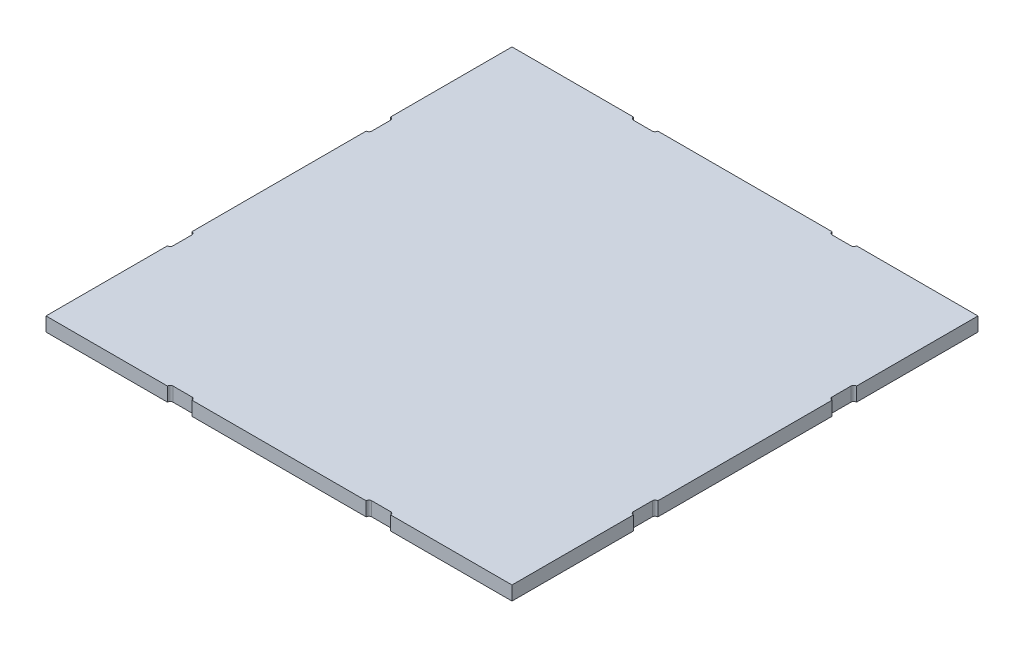
ISO-10303-21;
HEADER;
FILE_DESCRIPTION(('STEP AP214'),'2;1');
FILE_NAME('part.step','',(''),(''),'','','');
FILE_SCHEMA(('AUTOMOTIVE_DESIGN { 1 0 10303 214 1 1 1 1 }'));
ENDSEC;
DATA;
#1=APPLICATION_CONTEXT('core data for automotive mechanical design processes');
#2=APPLICATION_PROTOCOL_DEFINITION('international standard','automotive_design',2000,#1);
#3=PRODUCT_CONTEXT('',#1,'mechanical');
#4=PRODUCT('Part','Part','',(#3));
#5=PRODUCT_RELATED_PRODUCT_CATEGORY('part','',(#4));
#6=PRODUCT_DEFINITION_FORMATION('','',#4);
#7=PRODUCT_DEFINITION_CONTEXT('part definition',#1,'design');
#8=PRODUCT_DEFINITION('design','',#6,#7);
#9=PRODUCT_DEFINITION_SHAPE('','',#8);
#10=(LENGTH_UNIT() NAMED_UNIT(*) SI_UNIT(.MILLI.,.METRE.));
#11=(NAMED_UNIT(*) PLANE_ANGLE_UNIT() SI_UNIT($,.RADIAN.));
#12=(NAMED_UNIT(*) SI_UNIT($,.STERADIAN.) SOLID_ANGLE_UNIT());
#13=UNCERTAINTY_MEASURE_WITH_UNIT(LENGTH_MEASURE(1.E-05),#10,'distance_accuracy_value','');
#14=(GEOMETRIC_REPRESENTATION_CONTEXT(3) GLOBAL_UNCERTAINTY_ASSIGNED_CONTEXT((#13)) GLOBAL_UNIT_ASSIGNED_CONTEXT((#10,
#11,#12)) REPRESENTATION_CONTEXT('',''));
#15=CARTESIAN_POINT('',(0.,0.,0.));
#16=DIRECTION('',(0.,0.,1.));
#17=DIRECTION('',(1.,0.,0.));
#18=AXIS2_PLACEMENT_3D('',#15,#16,#17);
#19=CARTESIAN_POINT('',(-166.5,10.,-166.5));
#20=DIRECTION('',(0.,0.,1.));
#21=DIRECTION('',(1.,0.,0.));
#22=AXIS2_PLACEMENT_3D('',#19,#20,#21);
#23=PLANE('',#22);
#24=DIRECTION('',(-1.,0.,0.));
#25=VECTOR('',#24,1.);
#26=CARTESIAN_POINT('',(-166.5,0.,-166.5));
#27=LINE('',#26,#25);
#28=CARTESIAN_POINT('',(62.25,0.,-166.5));
#29=VERTEX_POINT('',#28);
#30=CARTESIAN_POINT('',(-62.25,0.,-166.5));
#31=VERTEX_POINT('',#30);
#32=EDGE_CURVE('E292',#29,#31,#27,.T.);
#33=ORIENTED_EDGE('',*,*,#32,.T.);
#34=DIRECTION('',(0.,1.,0.));
#35=VECTOR('',#34,1.);
#36=CARTESIAN_POINT('',(-62.25,0.,-166.5));
#37=LINE('',#36,#35);
#38=CARTESIAN_POINT('',(-62.25,10.,-166.5));
#39=VERTEX_POINT('',#38);
#40=EDGE_CURVE('E878',#31,#39,#37,.T.);
#41=ORIENTED_EDGE('',*,*,#40,.T.);
#42=DIRECTION('',(-1.,0.,0.));
#43=VECTOR('',#42,1.);
#44=CARTESIAN_POINT('',(-166.5,10.,-166.5));
#45=LINE('',#44,#43);
#46=CARTESIAN_POINT('',(62.25,10.,-166.5));
#47=VERTEX_POINT('',#46);
#48=EDGE_CURVE('E346',#47,#39,#45,.T.);
#49=ORIENTED_EDGE('',*,*,#48,.F.);
#50=DIRECTION('',(0.,1.,0.));
#51=VECTOR('',#50,1.);
#52=CARTESIAN_POINT('',(62.25,0.,-166.5));
#53=LINE('',#52,#51);
#54=EDGE_CURVE('E564',#29,#47,#53,.T.);
#55=ORIENTED_EDGE('',*,*,#54,.F.);
#56=EDGE_LOOP('',(#33,#41,#49,#55));
#57=FACE_BOUND('',#56,.T.);
#58=ADVANCED_FACE('F35',(#57),#23,.F.);
#59=CARTESIAN_POINT('',(166.5,0.,-166.5));
#60=VERTEX_POINT('',#59);
#61=CARTESIAN_POINT('',(79.75,0.,-166.5));
#62=VERTEX_POINT('',#61);
#63=EDGE_CURVE('E295',#60,#62,#27,.T.);
#64=ORIENTED_EDGE('',*,*,#63,.T.);
#65=DIRECTION('',(0.,1.,0.));
#66=VECTOR('',#65,1.);
#67=CARTESIAN_POINT('',(79.75,0.,-166.5));
#68=LINE('',#67,#66);
#69=CARTESIAN_POINT('',(79.75,10.,-166.5));
#70=VERTEX_POINT('',#69);
#71=EDGE_CURVE('E547',#62,#70,#68,.T.);
#72=ORIENTED_EDGE('',*,*,#71,.T.);
#73=CARTESIAN_POINT('',(166.5,10.,-166.5));
#74=VERTEX_POINT('',#73);
#75=EDGE_CURVE('E347',#74,#70,#45,.T.);
#76=ORIENTED_EDGE('',*,*,#75,.F.);
#77=DIRECTION('',(0.,-1.,0.));
#78=VECTOR('',#77,1.);
#79=CARTESIAN_POINT('',(166.5,10.,-166.5));
#80=LINE('',#79,#78);
#81=EDGE_CURVE('E11',#74,#60,#80,.T.);
#82=ORIENTED_EDGE('',*,*,#81,.T.);
#83=EDGE_LOOP('',(#64,#72,#76,#82));
#84=FACE_BOUND('',#83,.T.);
#85=ADVANCED_FACE('F546',(#84),#23,.F.);
#86=CARTESIAN_POINT('',(-166.5,10.,-166.5));
#87=DIRECTION('',(1.,0.,0.));
#88=DIRECTION('',(0.,0.,-1.));
#89=AXIS2_PLACEMENT_3D('',#86,#87,#88);
#90=PLANE('',#89);
#91=DIRECTION('',(0.,0.,1.));
#92=VECTOR('',#91,1.);
#93=CARTESIAN_POINT('',(-166.5,0.,-166.5));
#94=LINE('',#93,#92);
#95=CARTESIAN_POINT('',(-166.5,0.,-62.25));
#96=VERTEX_POINT('',#95);
#97=CARTESIAN_POINT('',(-166.5,0.,62.25));
#98=VERTEX_POINT('',#97);
#99=EDGE_CURVE('E307',#96,#98,#94,.T.);
#100=ORIENTED_EDGE('',*,*,#99,.T.);
#101=DIRECTION('',(0.,1.,0.));
#102=VECTOR('',#101,1.);
#103=CARTESIAN_POINT('',(-166.5,0.,62.25));
#104=LINE('',#103,#102);
#105=CARTESIAN_POINT('',(-166.5,10.,62.25));
#106=VERTEX_POINT('',#105);
#107=EDGE_CURVE('E581',#98,#106,#104,.T.);
#108=ORIENTED_EDGE('',*,*,#107,.T.);
#109=DIRECTION('',(0.,0.,1.));
#110=VECTOR('',#109,1.);
#111=CARTESIAN_POINT('',(-166.5,10.,-166.5));
#112=LINE('',#111,#110);
#113=CARTESIAN_POINT('',(-166.5,10.,-62.25));
#114=VERTEX_POINT('',#113);
#115=EDGE_CURVE('E353',#114,#106,#112,.T.);
#116=ORIENTED_EDGE('',*,*,#115,.F.);
#117=DIRECTION('',(0.,1.,0.));
#118=VECTOR('',#117,1.);
#119=CARTESIAN_POINT('',(-166.5,0.,-62.25));
#120=LINE('',#119,#118);
#121=EDGE_CURVE('E392',#96,#114,#120,.T.);
#122=ORIENTED_EDGE('',*,*,#121,.F.);
#123=EDGE_LOOP('',(#100,#108,#116,#122));
#124=FACE_BOUND('',#123,.T.);
#125=ADVANCED_FACE('F610',(#124),#90,.F.);
#126=CARTESIAN_POINT('',(-166.5,0.,-166.5));
#127=VERTEX_POINT('',#126);
#128=CARTESIAN_POINT('',(-166.5,0.,-79.75));
#129=VERTEX_POINT('',#128);
#130=EDGE_CURVE('E291',#127,#129,#94,.T.);
#131=ORIENTED_EDGE('',*,*,#130,.T.);
#132=DIRECTION('',(0.,1.,0.));
#133=VECTOR('',#132,1.);
#134=CARTESIAN_POINT('',(-166.5,0.,-79.75));
#135=LINE('',#134,#133);
#136=CARTESIAN_POINT('',(-166.5,10.,-79.75));
#137=VERTEX_POINT('',#136);
#138=EDGE_CURVE('E376',#129,#137,#135,.T.);
#139=ORIENTED_EDGE('',*,*,#138,.T.);
#140=CARTESIAN_POINT('',(-166.5,10.,-166.5));
#141=VERTEX_POINT('',#140);
#142=EDGE_CURVE('E354',#141,#137,#112,.T.);
#143=ORIENTED_EDGE('',*,*,#142,.F.);
#144=DIRECTION('',(0.,-1.,0.));
#145=VECTOR('',#144,1.);
#146=CARTESIAN_POINT('',(-166.5,10.,-166.5));
#147=LINE('',#146,#145);
#148=EDGE_CURVE('E43',#141,#127,#147,.T.);
#149=ORIENTED_EDGE('',*,*,#148,.T.);
#150=EDGE_LOOP('',(#131,#139,#143,#149));
#151=FACE_BOUND('',#150,.T.);
#152=ADVANCED_FACE('F375',(#151),#90,.F.);
#153=CARTESIAN_POINT('',(166.5,10.,-166.5));
#154=DIRECTION('',(-1.,0.,0.));
#155=DIRECTION('',(0.,0.,1.));
#156=AXIS2_PLACEMENT_3D('',#153,#154,#155);
#157=PLANE('',#156);
#158=DIRECTION('',(0.,0.,-1.));
#159=VECTOR('',#158,1.);
#160=CARTESIAN_POINT('',(166.5,0.,-166.5));
#161=LINE('',#160,#159);
#162=CARTESIAN_POINT('',(166.5,0.,62.25));
#163=VERTEX_POINT('',#162);
#164=CARTESIAN_POINT('',(166.5,0.,-62.25));
#165=VERTEX_POINT('',#164);
#166=EDGE_CURVE('E298',#163,#165,#161,.T.);
#167=ORIENTED_EDGE('',*,*,#166,.T.);
#168=DIRECTION('',(0.,1.,0.));
#169=VECTOR('',#168,1.);
#170=CARTESIAN_POINT('',(166.5,0.,-62.25));
#171=LINE('',#170,#169);
#172=CARTESIAN_POINT('',(166.5,10.,-62.25));
#173=VERTEX_POINT('',#172);
#174=EDGE_CURVE('E409',#165,#173,#171,.T.);
#175=ORIENTED_EDGE('',*,*,#174,.T.);
#176=DIRECTION('',(0.,0.,-1.));
#177=VECTOR('',#176,1.);
#178=CARTESIAN_POINT('',(166.5,10.,-166.5));
#179=LINE('',#178,#177);
#180=CARTESIAN_POINT('',(166.5,10.,62.25));
#181=VERTEX_POINT('',#180);
#182=EDGE_CURVE('E332',#181,#173,#179,.T.);
#183=ORIENTED_EDGE('',*,*,#182,.F.);
#184=DIRECTION('',(0.,1.,0.));
#185=VECTOR('',#184,1.);
#186=CARTESIAN_POINT('',(166.5,0.,62.25));
#187=LINE('',#186,#185);
#188=EDGE_CURVE('E454',#163,#181,#187,.T.);
#189=ORIENTED_EDGE('',*,*,#188,.F.);
#190=EDGE_LOOP('',(#167,#175,#183,#189));
#191=FACE_BOUND('',#190,.T.);
#192=ADVANCED_FACE('F532',(#191),#157,.F.);
#193=CARTESIAN_POINT('',(-166.5,10.,166.5));
#194=DIRECTION('',(0.,0.,-1.));
#195=DIRECTION('',(-1.,0.,0.));
#196=AXIS2_PLACEMENT_3D('',#193,#194,#195);
#197=PLANE('',#196);
#198=DIRECTION('',(1.,0.,0.));
#199=VECTOR('',#198,1.);
#200=CARTESIAN_POINT('',(-166.5,0.,166.5));
#201=LINE('',#200,#199);
#202=CARTESIAN_POINT('',(-62.25,0.,166.5));
#203=VERTEX_POINT('',#202);
#204=CARTESIAN_POINT('',(62.25,0.,166.5));
#205=VERTEX_POINT('',#204);
#206=EDGE_CURVE('E318',#203,#205,#201,.T.);
#207=ORIENTED_EDGE('',*,*,#206,.T.);
#208=DIRECTION('',(0.,1.,0.));
#209=VECTOR('',#208,1.);
#210=CARTESIAN_POINT('',(62.25,0.,166.5));
#211=LINE('',#210,#209);
#212=CARTESIAN_POINT('',(62.25,10.,166.5));
#213=VERTEX_POINT('',#212);
#214=EDGE_CURVE('E435',#205,#213,#211,.T.);
#215=ORIENTED_EDGE('',*,*,#214,.T.);
#216=DIRECTION('',(1.,0.,0.));
#217=VECTOR('',#216,1.);
#218=CARTESIAN_POINT('',(-166.5,10.,166.5));
#219=LINE('',#218,#217);
#220=CARTESIAN_POINT('',(-62.25,10.,166.5));
#221=VERTEX_POINT('',#220);
#222=EDGE_CURVE('E363',#221,#213,#219,.T.);
#223=ORIENTED_EDGE('',*,*,#222,.F.);
#224=DIRECTION('',(0.,1.,0.));
#225=VECTOR('',#224,1.);
#226=CARTESIAN_POINT('',(-62.25,0.,166.5));
#227=LINE('',#226,#225);
#228=EDGE_CURVE('E480',#203,#221,#227,.T.);
#229=ORIENTED_EDGE('',*,*,#228,.F.);
#230=EDGE_LOOP('',(#207,#215,#223,#229));
#231=FACE_BOUND('',#230,.T.);
#232=ADVANCED_FACE('F504',(#231),#197,.F.);
#233=CARTESIAN_POINT('',(166.5,0.,166.5));
#234=VERTEX_POINT('',#233);
#235=CARTESIAN_POINT('',(166.5,0.,79.75));
#236=VERTEX_POINT('',#235);
#237=EDGE_CURVE('E293',#234,#236,#161,.T.);
#238=ORIENTED_EDGE('',*,*,#237,.T.);
#239=DIRECTION('',(0.,1.,0.));
#240=VECTOR('',#239,1.);
#241=CARTESIAN_POINT('',(166.5,0.,79.75));
#242=LINE('',#241,#240);
#243=CARTESIAN_POINT('',(166.5,10.,79.75));
#244=VERTEX_POINT('',#243);
#245=EDGE_CURVE('E461',#236,#244,#242,.T.);
#246=ORIENTED_EDGE('',*,*,#245,.T.);
#247=CARTESIAN_POINT('',(166.5,10.,166.5));
#248=VERTEX_POINT('',#247);
#249=EDGE_CURVE('E334',#248,#244,#179,.T.);
#250=ORIENTED_EDGE('',*,*,#249,.F.);
#251=DIRECTION('',(0.,-1.,0.));
#252=VECTOR('',#251,1.);
#253=CARTESIAN_POINT('',(166.5,10.,166.5));
#254=LINE('',#253,#252);
#255=EDGE_CURVE('E368',#248,#234,#254,.T.);
#256=ORIENTED_EDGE('',*,*,#255,.T.);
#257=EDGE_LOOP('',(#238,#246,#250,#256));
#258=FACE_BOUND('',#257,.T.);
#259=ADVANCED_FACE('F515',(#258),#157,.F.);
#260=CARTESIAN_POINT('',(-166.5,0.,166.5));
#261=VERTEX_POINT('',#260);
#262=CARTESIAN_POINT('',(-79.75,0.,166.5));
#263=VERTEX_POINT('',#262);
#264=EDGE_CURVE('E319',#261,#263,#201,.T.);
#265=ORIENTED_EDGE('',*,*,#264,.T.);
#266=DIRECTION('',(0.,1.,0.));
#267=VECTOR('',#266,1.);
#268=CARTESIAN_POINT('',(-79.75,0.,166.5));
#269=LINE('',#268,#267);
#270=CARTESIAN_POINT('',(-79.75,10.,166.5));
#271=VERTEX_POINT('',#270);
#272=EDGE_CURVE('E487',#263,#271,#269,.T.);
#273=ORIENTED_EDGE('',*,*,#272,.T.);
#274=CARTESIAN_POINT('',(-166.5,10.,166.5));
#275=VERTEX_POINT('',#274);
#276=EDGE_CURVE('E364',#275,#271,#219,.T.);
#277=ORIENTED_EDGE('',*,*,#276,.F.);
#278=DIRECTION('',(0.,-1.,0.));
#279=VECTOR('',#278,1.);
#280=CARTESIAN_POINT('',(-166.5,10.,166.5));
#281=LINE('',#280,#279);
#282=EDGE_CURVE('E371',#275,#261,#281,.T.);
#283=ORIENTED_EDGE('',*,*,#282,.T.);
#284=EDGE_LOOP('',(#265,#273,#277,#283));
#285=FACE_BOUND('',#284,.T.);
#286=ADVANCED_FACE('F622',(#285),#197,.F.);
#287=CARTESIAN_POINT('',(166.5,10.,-79.75));
#288=VERTEX_POINT('',#287);
#289=EDGE_CURVE('E328',#288,#74,#179,.T.);
#290=ORIENTED_EDGE('',*,*,#289,.F.);
#291=DIRECTION('',(0.,1.,0.));
#292=VECTOR('',#291,1.);
#293=CARTESIAN_POINT('',(166.5,0.,-79.75));
#294=LINE('',#293,#292);
#295=CARTESIAN_POINT('',(166.5,0.,-79.75));
#296=VERTEX_POINT('',#295);
#297=EDGE_CURVE('E404',#296,#288,#294,.T.);
#298=ORIENTED_EDGE('',*,*,#297,.F.);
#299=EDGE_CURVE('E300',#296,#60,#161,.T.);
#300=ORIENTED_EDGE('',*,*,#299,.T.);
#301=ORIENTED_EDGE('',*,*,#81,.F.);
#302=EDGE_LOOP('',(#290,#298,#300,#301));
#303=FACE_BOUND('',#302,.T.);
#304=ADVANCED_FACE('F37',(#303),#157,.F.);
#305=CARTESIAN_POINT('',(-79.75,10.,-166.5));
#306=VERTEX_POINT('',#305);
#307=EDGE_CURVE('E284',#306,#141,#45,.T.);
#308=ORIENTED_EDGE('',*,*,#307,.F.);
#309=DIRECTION('',(0.,1.,0.));
#310=VECTOR('',#309,1.);
#311=CARTESIAN_POINT('',(-79.75,0.,-166.5));
#312=LINE('',#311,#310);
#313=CARTESIAN_POINT('',(-79.75,0.,-166.5));
#314=VERTEX_POINT('',#313);
#315=EDGE_CURVE('E271',#314,#306,#312,.T.);
#316=ORIENTED_EDGE('',*,*,#315,.F.);
#317=EDGE_CURVE('E282',#314,#127,#27,.T.);
#318=ORIENTED_EDGE('',*,*,#317,.T.);
#319=ORIENTED_EDGE('',*,*,#148,.F.);
#320=EDGE_LOOP('',(#308,#316,#318,#319));
#321=FACE_BOUND('',#320,.T.);
#322=ADVANCED_FACE('F280',(#321),#23,.F.);
#323=CARTESIAN_POINT('',(-166.5,10.,79.75));
#324=VERTEX_POINT('',#323);
#325=EDGE_CURVE('E351',#324,#275,#112,.T.);
#326=ORIENTED_EDGE('',*,*,#325,.F.);
#327=DIRECTION('',(0.,1.,0.));
#328=VECTOR('',#327,1.);
#329=CARTESIAN_POINT('',(-166.5,0.,79.75));
#330=LINE('',#329,#328);
#331=CARTESIAN_POINT('',(-166.5,0.,79.75));
#332=VERTEX_POINT('',#331);
#333=EDGE_CURVE('E576',#332,#324,#330,.T.);
#334=ORIENTED_EDGE('',*,*,#333,.F.);
#335=EDGE_CURVE('E303',#332,#261,#94,.T.);
#336=ORIENTED_EDGE('',*,*,#335,.T.);
#337=ORIENTED_EDGE('',*,*,#282,.F.);
#338=EDGE_LOOP('',(#326,#334,#336,#337));
#339=FACE_BOUND('',#338,.T.);
#340=ADVANCED_FACE('F621',(#339),#90,.F.);
#341=CARTESIAN_POINT('',(79.75,10.,166.5));
#342=VERTEX_POINT('',#341);
#343=EDGE_CURVE('E360',#342,#248,#219,.T.);
#344=ORIENTED_EDGE('',*,*,#343,.F.);
#345=DIRECTION('',(0.,1.,0.));
#346=VECTOR('',#345,1.);
#347=CARTESIAN_POINT('',(79.75,0.,166.5));
#348=LINE('',#347,#346);
#349=CARTESIAN_POINT('',(79.75,0.,166.5));
#350=VERTEX_POINT('',#349);
#351=EDGE_CURVE('E428',#350,#342,#348,.T.);
#352=ORIENTED_EDGE('',*,*,#351,.F.);
#353=EDGE_CURVE('E315',#350,#234,#201,.T.);
#354=ORIENTED_EDGE('',*,*,#353,.T.);
#355=ORIENTED_EDGE('',*,*,#255,.F.);
#356=EDGE_LOOP('',(#344,#352,#354,#355));
#357=FACE_BOUND('',#356,.T.);
#358=ADVANCED_FACE('F514',(#357),#197,.F.);
#359=CARTESIAN_POINT('',(0.,10.,0.));
#360=DIRECTION('',(0.,1.,0.));
#361=DIRECTION('',(0.,0.,1.));
#362=AXIS2_PLACEMENT_3D('',#359,#360,#361);
#363=PLANE('',#362);
#364=CARTESIAN_POINT('',(-64.25,10.,-166.5));
#365=DIRECTION('',(0.,1.,0.));
#366=DIRECTION('',(0.,0.,-1.));
#367=AXIS2_PLACEMENT_3D('',#364,#365,#366);
#368=CIRCLE('',#367,2.);
#369=CARTESIAN_POINT('',(-64.25,10.,-164.5));
#370=VERTEX_POINT('',#369);
#371=EDGE_CURVE('E276',#370,#39,#368,.T.);
#372=ORIENTED_EDGE('',*,*,#371,.F.);
#373=DIRECTION('',(1.,0.,0.));
#374=VECTOR('',#373,1.);
#375=CARTESIAN_POINT('',(-77.75,10.,-164.5));
#376=LINE('',#375,#374);
#377=CARTESIAN_POINT('',(-77.75,10.,-164.5));
#378=VERTEX_POINT('',#377);
#379=EDGE_CURVE('E867',#378,#370,#376,.T.);
#380=ORIENTED_EDGE('',*,*,#379,.F.);
#381=CARTESIAN_POINT('',(-77.75,10.,-166.5));
#382=DIRECTION('',(0.,1.,0.));
#383=DIRECTION('',(0.,0.,-1.));
#384=AXIS2_PLACEMENT_3D('',#381,#382,#383);
#385=CIRCLE('',#384,2.);
#386=EDGE_CURVE('E870',#306,#378,#385,.T.);
#387=ORIENTED_EDGE('',*,*,#386,.F.);
#388=ORIENTED_EDGE('',*,*,#307,.T.);
#389=ORIENTED_EDGE('',*,*,#142,.T.);
#390=CARTESIAN_POINT('',(-166.5,10.,-77.75));
#391=DIRECTION('',(0.,1.,0.));
#392=DIRECTION('',(0.,0.,1.));
#393=AXIS2_PLACEMENT_3D('',#390,#391,#392);
#394=CIRCLE('',#393,2.);
#395=CARTESIAN_POINT('',(-164.5,10.,-77.75));
#396=VERTEX_POINT('',#395);
#397=EDGE_CURVE('E388',#396,#137,#394,.T.);
#398=ORIENTED_EDGE('',*,*,#397,.F.);
#399=DIRECTION('',(0.,0.,-1.));
#400=VECTOR('',#399,1.);
#401=CARTESIAN_POINT('',(-164.5,10.,-64.25));
#402=LINE('',#401,#400);
#403=CARTESIAN_POINT('',(-164.5,10.,-64.25));
#404=VERTEX_POINT('',#403);
#405=EDGE_CURVE('E598',#404,#396,#402,.T.);
#406=ORIENTED_EDGE('',*,*,#405,.F.);
#407=CARTESIAN_POINT('',(-166.5,10.,-64.25));
#408=DIRECTION('',(0.,1.,0.));
#409=DIRECTION('',(0.,0.,-1.));
#410=AXIS2_PLACEMENT_3D('',#407,#408,#409);
#411=CIRCLE('',#410,2.);
#412=EDGE_CURVE('E584',#114,#404,#411,.T.);
#413=ORIENTED_EDGE('',*,*,#412,.F.);
#414=ORIENTED_EDGE('',*,*,#115,.T.);
#415=CARTESIAN_POINT('',(-166.5,10.,64.25));
#416=DIRECTION('',(0.,1.,0.));
#417=DIRECTION('',(0.,0.,1.));
#418=AXIS2_PLACEMENT_3D('',#415,#416,#417);
#419=CIRCLE('',#418,2.);
#420=CARTESIAN_POINT('',(-164.5,10.,64.25));
#421=VERTEX_POINT('',#420);
#422=EDGE_CURVE('E571',#421,#106,#419,.T.);
#423=ORIENTED_EDGE('',*,*,#422,.F.);
#424=DIRECTION('',(0.,0.,-1.));
#425=VECTOR('',#424,1.);
#426=CARTESIAN_POINT('',(-164.5,10.,64.25));
#427=LINE('',#426,#425);
#428=CARTESIAN_POINT('',(-164.5,10.,77.75));
#429=VERTEX_POINT('',#428);
#430=EDGE_CURVE('E555',#429,#421,#427,.T.);
#431=ORIENTED_EDGE('',*,*,#430,.F.);
#432=CARTESIAN_POINT('',(-166.5,10.,77.75));
#433=DIRECTION('',(0.,1.,0.));
#434=DIRECTION('',(0.,0.,-1.));
#435=AXIS2_PLACEMENT_3D('',#432,#433,#434);
#436=CIRCLE('',#435,2.);
#437=EDGE_CURVE('E551',#324,#429,#436,.T.);
#438=ORIENTED_EDGE('',*,*,#437,.F.);
#439=ORIENTED_EDGE('',*,*,#325,.T.);
#440=ORIENTED_EDGE('',*,*,#276,.T.);
#441=CARTESIAN_POINT('',(-77.75,10.,166.5));
#442=DIRECTION('',(0.,1.,0.));
#443=DIRECTION('',(0.,0.,1.));
#444=AXIS2_PLACEMENT_3D('',#441,#442,#443);
#445=CIRCLE('',#444,2.);
#446=CARTESIAN_POINT('',(-77.75,10.,164.5));
#447=VERTEX_POINT('',#446);
#448=EDGE_CURVE('E474',#447,#271,#445,.T.);
#449=ORIENTED_EDGE('',*,*,#448,.F.);
#450=DIRECTION('',(-1.,0.,0.));
#451=VECTOR('',#450,1.);
#452=CARTESIAN_POINT('',(-77.75,10.,164.5));
#453=LINE('',#452,#451);
#454=CARTESIAN_POINT('',(-64.25,10.,164.5));
#455=VERTEX_POINT('',#454);
#456=EDGE_CURVE('E483',#455,#447,#453,.T.);
#457=ORIENTED_EDGE('',*,*,#456,.F.);
#458=CARTESIAN_POINT('',(-64.25,10.,166.5));
#459=DIRECTION('',(0.,1.,0.));
#460=DIRECTION('',(0.,0.,1.));
#461=AXIS2_PLACEMENT_3D('',#458,#459,#460);
#462=CIRCLE('',#461,2.);
#463=EDGE_CURVE('E464',#221,#455,#462,.T.);
#464=ORIENTED_EDGE('',*,*,#463,.F.);
#465=ORIENTED_EDGE('',*,*,#222,.T.);
#466=CARTESIAN_POINT('',(64.25,10.,166.5));
#467=DIRECTION('',(0.,1.,0.));
#468=DIRECTION('',(0.,0.,-1.));
#469=AXIS2_PLACEMENT_3D('',#466,#467,#468);
#470=CIRCLE('',#469,2.);
#471=CARTESIAN_POINT('',(64.25,10.,164.5));
#472=VERTEX_POINT('',#471);
#473=EDGE_CURVE('E422',#472,#213,#470,.T.);
#474=ORIENTED_EDGE('',*,*,#473,.F.);
#475=DIRECTION('',(-1.,0.,0.));
#476=VECTOR('',#475,1.);
#477=CARTESIAN_POINT('',(77.75,10.,164.5));
#478=LINE('',#477,#476);
#479=CARTESIAN_POINT('',(77.75,10.,164.5));
#480=VERTEX_POINT('',#479);
#481=EDGE_CURVE('E431',#480,#472,#478,.T.);
#482=ORIENTED_EDGE('',*,*,#481,.F.);
#483=CARTESIAN_POINT('',(77.75,10.,166.5));
#484=DIRECTION('',(0.,1.,0.));
#485=DIRECTION('',(0.,0.,-1.));
#486=AXIS2_PLACEMENT_3D('',#483,#484,#485);
#487=CIRCLE('',#486,2.);
#488=EDGE_CURVE('E412',#342,#480,#487,.T.);
#489=ORIENTED_EDGE('',*,*,#488,.F.);
#490=ORIENTED_EDGE('',*,*,#343,.T.);
#491=ORIENTED_EDGE('',*,*,#249,.T.);
#492=CARTESIAN_POINT('',(166.5,10.,77.75));
#493=DIRECTION('',(0.,1.,0.));
#494=DIRECTION('',(0.,0.,1.));
#495=AXIS2_PLACEMENT_3D('',#492,#493,#494);
#496=CIRCLE('',#495,2.);
#497=CARTESIAN_POINT('',(164.5,10.,77.75));
#498=VERTEX_POINT('',#497);
#499=EDGE_CURVE('E448',#498,#244,#496,.T.);
#500=ORIENTED_EDGE('',*,*,#499,.F.);
#501=DIRECTION('',(0.,0.,1.));
#502=VECTOR('',#501,1.);
#503=CARTESIAN_POINT('',(164.5,10.,64.25));
#504=LINE('',#503,#502);
#505=CARTESIAN_POINT('',(164.5,10.,64.25));
#506=VERTEX_POINT('',#505);
#507=EDGE_CURVE('E457',#506,#498,#504,.T.);
#508=ORIENTED_EDGE('',*,*,#507,.F.);
#509=CARTESIAN_POINT('',(166.5,10.,64.25));
#510=DIRECTION('',(0.,1.,0.));
#511=DIRECTION('',(0.,0.,-1.));
#512=AXIS2_PLACEMENT_3D('',#509,#510,#511);
#513=CIRCLE('',#512,2.);
#514=EDGE_CURVE('E438',#181,#506,#513,.T.);
#515=ORIENTED_EDGE('',*,*,#514,.F.);
#516=ORIENTED_EDGE('',*,*,#182,.T.);
#517=CARTESIAN_POINT('',(166.5,10.,-64.25));
#518=DIRECTION('',(0.,1.,0.));
#519=DIRECTION('',(0.,0.,1.));
#520=AXIS2_PLACEMENT_3D('',#517,#518,#519);
#521=CIRCLE('',#520,2.);
#522=CARTESIAN_POINT('',(164.5,10.,-64.25));
#523=VERTEX_POINT('',#522);
#524=EDGE_CURVE('E399',#523,#173,#521,.T.);
#525=ORIENTED_EDGE('',*,*,#524,.F.);
#526=DIRECTION('',(0.,0.,1.));
#527=VECTOR('',#526,1.);
#528=CARTESIAN_POINT('',(164.5,10.,-64.25));
#529=LINE('',#528,#527);
#530=CARTESIAN_POINT('',(164.5,10.,-77.75));
#531=VERTEX_POINT('',#530);
#532=EDGE_CURVE('E383',#531,#523,#529,.T.);
#533=ORIENTED_EDGE('',*,*,#532,.F.);
#534=CARTESIAN_POINT('',(166.5,10.,-77.75));
#535=DIRECTION('',(0.,1.,0.));
#536=DIRECTION('',(0.,0.,-1.));
#537=AXIS2_PLACEMENT_3D('',#534,#535,#536);
#538=CIRCLE('',#537,2.);
#539=EDGE_CURVE('E379',#288,#531,#538,.T.);
#540=ORIENTED_EDGE('',*,*,#539,.F.);
#541=ORIENTED_EDGE('',*,*,#289,.T.);
#542=ORIENTED_EDGE('',*,*,#75,.T.);
#543=CARTESIAN_POINT('',(77.75,10.,-166.5));
#544=DIRECTION('',(0.,1.,0.));
#545=DIRECTION('',(0.,0.,1.));
#546=AXIS2_PLACEMENT_3D('',#543,#544,#545);
#547=CIRCLE('',#546,2.);
#548=CARTESIAN_POINT('',(77.75,10.,-164.5));
#549=VERTEX_POINT('',#548);
#550=EDGE_CURVE('E560',#549,#70,#547,.T.);
#551=ORIENTED_EDGE('',*,*,#550,.F.);
#552=DIRECTION('',(1.,0.,0.));
#553=VECTOR('',#552,1.);
#554=CARTESIAN_POINT('',(77.75,10.,-164.5));
#555=LINE('',#554,#553);
#556=CARTESIAN_POINT('',(64.25,10.,-164.5));
#557=VERTEX_POINT('',#556);
#558=EDGE_CURVE('E889',#557,#549,#555,.T.);
#559=ORIENTED_EDGE('',*,*,#558,.F.);
#560=CARTESIAN_POINT('',(64.25,10.,-166.5));
#561=DIRECTION('',(0.,1.,0.));
#562=DIRECTION('',(0.,0.,1.));
#563=AXIS2_PLACEMENT_3D('',#560,#561,#562);
#564=CIRCLE('',#563,2.);
#565=EDGE_CURVE('E880',#47,#557,#564,.T.);
#566=ORIENTED_EDGE('',*,*,#565,.F.);
#567=ORIENTED_EDGE('',*,*,#48,.T.);
#568=EDGE_LOOP('',(#372,#380,#387,#388,#389,#398,#406,#413,#414,#423,#431,#438,#439,#440,#449,
#457,#464,#465,#474,#482,#489,#490,#491,#500,#508,#515,#516,#525,#533,#540,#541,#542,#551,#559,
#566,#567));
#569=FACE_BOUND('',#568,.T.);
#570=ADVANCED_FACE('F502',(#569),#363,.T.);
#571=CARTESIAN_POINT('',(0.,0.,0.));
#572=DIRECTION('',(0.,1.,0.));
#573=DIRECTION('',(0.,0.,1.));
#574=AXIS2_PLACEMENT_3D('',#571,#572,#573);
#575=PLANE('',#574);
#576=DIRECTION('',(1.,0.,0.));
#577=VECTOR('',#576,1.);
#578=CARTESIAN_POINT('',(-77.75,0.,-164.5));
#579=LINE('',#578,#577);
#580=CARTESIAN_POINT('',(-77.75,0.,-164.5));
#581=VERTEX_POINT('',#580);
#582=CARTESIAN_POINT('',(-64.25,0.,-164.5));
#583=VERTEX_POINT('',#582);
#584=EDGE_CURVE('E50',#581,#583,#579,.T.);
#585=ORIENTED_EDGE('',*,*,#584,.T.);
#586=CARTESIAN_POINT('',(-64.25,0.,-166.5));
#587=DIRECTION('',(0.,1.,0.));
#588=DIRECTION('',(0.,0.,-1.));
#589=AXIS2_PLACEMENT_3D('',#586,#587,#588);
#590=CIRCLE('',#589,2.);
#591=EDGE_CURVE('E285',#583,#31,#590,.T.);
#592=ORIENTED_EDGE('',*,*,#591,.T.);
#593=ORIENTED_EDGE('',*,*,#32,.F.);
#594=CARTESIAN_POINT('',(64.25,0.,-166.5));
#595=DIRECTION('',(0.,1.,0.));
#596=DIRECTION('',(0.,0.,1.));
#597=AXIS2_PLACEMENT_3D('',#594,#595,#596);
#598=CIRCLE('',#597,2.);
#599=CARTESIAN_POINT('',(64.25,0.,-164.5));
#600=VERTEX_POINT('',#599);
#601=EDGE_CURVE('E883',#29,#600,#598,.T.);
#602=ORIENTED_EDGE('',*,*,#601,.T.);
#603=DIRECTION('',(1.,0.,0.));
#604=VECTOR('',#603,1.);
#605=CARTESIAN_POINT('',(77.75,0.,-164.5));
#606=LINE('',#605,#604);
#607=CARTESIAN_POINT('',(77.75,0.,-164.5));
#608=VERTEX_POINT('',#607);
#609=EDGE_CURVE('E58',#600,#608,#606,.T.);
#610=ORIENTED_EDGE('',*,*,#609,.T.);
#611=CARTESIAN_POINT('',(77.75,0.,-166.5));
#612=DIRECTION('',(0.,1.,0.));
#613=DIRECTION('',(0.,0.,1.));
#614=AXIS2_PLACEMENT_3D('',#611,#612,#613);
#615=CIRCLE('',#614,2.);
#616=EDGE_CURVE('E566',#608,#62,#615,.T.);
#617=ORIENTED_EDGE('',*,*,#616,.T.);
#618=ORIENTED_EDGE('',*,*,#63,.F.);
#619=ORIENTED_EDGE('',*,*,#299,.F.);
#620=CARTESIAN_POINT('',(166.5,0.,-77.75));
#621=DIRECTION('',(0.,1.,0.));
#622=DIRECTION('',(0.,0.,-1.));
#623=AXIS2_PLACEMENT_3D('',#620,#621,#622);
#624=CIRCLE('',#623,2.);
#625=CARTESIAN_POINT('',(164.5,0.,-77.75));
#626=VERTEX_POINT('',#625);
#627=EDGE_CURVE('E395',#296,#626,#624,.T.);
#628=ORIENTED_EDGE('',*,*,#627,.T.);
#629=DIRECTION('',(0.,0.,1.));
#630=VECTOR('',#629,1.);
#631=CARTESIAN_POINT('',(164.5,0.,-64.25));
#632=LINE('',#631,#630);
#633=CARTESIAN_POINT('',(164.5,0.,-64.25));
#634=VERTEX_POINT('',#633);
#635=EDGE_CURVE('E398',#626,#634,#632,.T.);
#636=ORIENTED_EDGE('',*,*,#635,.T.);
#637=CARTESIAN_POINT('',(166.5,0.,-64.25));
#638=DIRECTION('',(0.,1.,0.));
#639=DIRECTION('',(0.,0.,1.));
#640=AXIS2_PLACEMENT_3D('',#637,#638,#639);
#641=CIRCLE('',#640,2.);
#642=EDGE_CURVE('E402',#634,#165,#641,.T.);
#643=ORIENTED_EDGE('',*,*,#642,.T.);
#644=ORIENTED_EDGE('',*,*,#166,.F.);
#645=CARTESIAN_POINT('',(166.5,0.,64.25));
#646=DIRECTION('',(0.,1.,0.));
#647=DIRECTION('',(0.,0.,-1.));
#648=AXIS2_PLACEMENT_3D('',#645,#646,#647);
#649=CIRCLE('',#648,2.);
#650=CARTESIAN_POINT('',(164.5,0.,64.25));
#651=VERTEX_POINT('',#650);
#652=EDGE_CURVE('E444',#163,#651,#649,.T.);
#653=ORIENTED_EDGE('',*,*,#652,.T.);
#654=DIRECTION('',(0.,0.,1.));
#655=VECTOR('',#654,1.);
#656=CARTESIAN_POINT('',(164.5,0.,64.25));
#657=LINE('',#656,#655);
#658=CARTESIAN_POINT('',(164.5,0.,77.75));
#659=VERTEX_POINT('',#658);
#660=EDGE_CURVE('E447',#651,#659,#657,.T.);
#661=ORIENTED_EDGE('',*,*,#660,.T.);
#662=CARTESIAN_POINT('',(166.5,0.,77.75));
#663=DIRECTION('',(0.,1.,0.));
#664=DIRECTION('',(0.,0.,1.));
#665=AXIS2_PLACEMENT_3D('',#662,#663,#664);
#666=CIRCLE('',#665,2.);
#667=EDGE_CURVE('E451',#659,#236,#666,.T.);
#668=ORIENTED_EDGE('',*,*,#667,.T.);
#669=ORIENTED_EDGE('',*,*,#237,.F.);
#670=ORIENTED_EDGE('',*,*,#353,.F.);
#671=CARTESIAN_POINT('',(77.75,0.,166.5));
#672=DIRECTION('',(0.,1.,0.));
#673=DIRECTION('',(0.,0.,-1.));
#674=AXIS2_PLACEMENT_3D('',#671,#672,#673);
#675=CIRCLE('',#674,2.);
#676=CARTESIAN_POINT('',(77.75,0.,164.5));
#677=VERTEX_POINT('',#676);
#678=EDGE_CURVE('E418',#350,#677,#675,.T.);
#679=ORIENTED_EDGE('',*,*,#678,.T.);
#680=DIRECTION('',(-1.,0.,0.));
#681=VECTOR('',#680,1.);
#682=CARTESIAN_POINT('',(77.75,0.,164.5));
#683=LINE('',#682,#681);
#684=CARTESIAN_POINT('',(64.25,0.,164.5));
#685=VERTEX_POINT('',#684);
#686=EDGE_CURVE('E421',#677,#685,#683,.T.);
#687=ORIENTED_EDGE('',*,*,#686,.T.);
#688=CARTESIAN_POINT('',(64.25,0.,166.5));
#689=DIRECTION('',(0.,1.,0.));
#690=DIRECTION('',(0.,0.,-1.));
#691=AXIS2_PLACEMENT_3D('',#688,#689,#690);
#692=CIRCLE('',#691,2.);
#693=EDGE_CURVE('E425',#685,#205,#692,.T.);
#694=ORIENTED_EDGE('',*,*,#693,.T.);
#695=ORIENTED_EDGE('',*,*,#206,.F.);
#696=CARTESIAN_POINT('',(-64.25,0.,166.5));
#697=DIRECTION('',(0.,1.,0.));
#698=DIRECTION('',(0.,0.,1.));
#699=AXIS2_PLACEMENT_3D('',#696,#697,#698);
#700=CIRCLE('',#699,2.);
#701=CARTESIAN_POINT('',(-64.25,0.,164.5));
#702=VERTEX_POINT('',#701);
#703=EDGE_CURVE('E470',#203,#702,#700,.T.);
#704=ORIENTED_EDGE('',*,*,#703,.T.);
#705=DIRECTION('',(-1.,0.,0.));
#706=VECTOR('',#705,1.);
#707=CARTESIAN_POINT('',(-77.75,0.,164.5));
#708=LINE('',#707,#706);
#709=CARTESIAN_POINT('',(-77.75,0.,164.5));
#710=VERTEX_POINT('',#709);
#711=EDGE_CURVE('E473',#702,#710,#708,.T.);
#712=ORIENTED_EDGE('',*,*,#711,.T.);
#713=CARTESIAN_POINT('',(-77.75,0.,166.5));
#714=DIRECTION('',(0.,1.,0.));
#715=DIRECTION('',(0.,0.,1.));
#716=AXIS2_PLACEMENT_3D('',#713,#714,#715);
#717=CIRCLE('',#716,2.);
#718=EDGE_CURVE('E477',#710,#263,#717,.T.);
#719=ORIENTED_EDGE('',*,*,#718,.T.);
#720=ORIENTED_EDGE('',*,*,#264,.F.);
#721=ORIENTED_EDGE('',*,*,#335,.F.);
#722=CARTESIAN_POINT('',(-166.5,0.,77.75));
#723=DIRECTION('',(0.,1.,0.));
#724=DIRECTION('',(0.,0.,-1.));
#725=AXIS2_PLACEMENT_3D('',#722,#723,#724);
#726=CIRCLE('',#725,2.);
#727=CARTESIAN_POINT('',(-164.5,0.,77.75));
#728=VERTEX_POINT('',#727);
#729=EDGE_CURVE('E567',#332,#728,#726,.T.);
#730=ORIENTED_EDGE('',*,*,#729,.T.);
#731=DIRECTION('',(0.,0.,-1.));
#732=VECTOR('',#731,1.);
#733=CARTESIAN_POINT('',(-164.5,0.,64.25));
#734=LINE('',#733,#732);
#735=CARTESIAN_POINT('',(-164.5,0.,64.25));
#736=VERTEX_POINT('',#735);
#737=EDGE_CURVE('E570',#728,#736,#734,.T.);
#738=ORIENTED_EDGE('',*,*,#737,.T.);
#739=CARTESIAN_POINT('',(-166.5,0.,64.25));
#740=DIRECTION('',(0.,1.,0.));
#741=DIRECTION('',(0.,0.,1.));
#742=AXIS2_PLACEMENT_3D('',#739,#740,#741);
#743=CIRCLE('',#742,2.);
#744=EDGE_CURVE('E574',#736,#98,#743,.T.);
#745=ORIENTED_EDGE('',*,*,#744,.T.);
#746=ORIENTED_EDGE('',*,*,#99,.F.);
#747=CARTESIAN_POINT('',(-166.5,0.,-64.25));
#748=DIRECTION('',(0.,1.,0.));
#749=DIRECTION('',(0.,0.,-1.));
#750=AXIS2_PLACEMENT_3D('',#747,#748,#749);
#751=CIRCLE('',#750,2.);
#752=CARTESIAN_POINT('',(-164.5,0.,-64.25));
#753=VERTEX_POINT('',#752);
#754=EDGE_CURVE('E590',#96,#753,#751,.T.);
#755=ORIENTED_EDGE('',*,*,#754,.T.);
#756=DIRECTION('',(0.,0.,-1.));
#757=VECTOR('',#756,1.);
#758=CARTESIAN_POINT('',(-164.5,0.,-64.25));
#759=LINE('',#758,#757);
#760=CARTESIAN_POINT('',(-164.5,0.,-77.75));
#761=VERTEX_POINT('',#760);
#762=EDGE_CURVE('E593',#753,#761,#759,.T.);
#763=ORIENTED_EDGE('',*,*,#762,.T.);
#764=CARTESIAN_POINT('',(-166.5,0.,-77.75));
#765=DIRECTION('',(0.,1.,0.));
#766=DIRECTION('',(0.,0.,1.));
#767=AXIS2_PLACEMENT_3D('',#764,#765,#766);
#768=CIRCLE('',#767,2.);
#769=EDGE_CURVE('E394',#761,#129,#768,.T.);
#770=ORIENTED_EDGE('',*,*,#769,.T.);
#771=ORIENTED_EDGE('',*,*,#130,.F.);
#772=ORIENTED_EDGE('',*,*,#317,.F.);
#773=CARTESIAN_POINT('',(-77.75,0.,-166.5));
#774=DIRECTION('',(0.,1.,0.));
#775=DIRECTION('',(0.,0.,-1.));
#776=AXIS2_PLACEMENT_3D('',#773,#774,#775);
#777=CIRCLE('',#776,2.);
#778=EDGE_CURVE('E267',#314,#581,#777,.T.);
#779=ORIENTED_EDGE('',*,*,#778,.T.);
#780=EDGE_LOOP('',(#585,#592,#593,#602,#610,#617,#618,#619,#628,#636,#643,#644,#653,#661,#668,
#669,#670,#679,#687,#694,#695,#704,#712,#719,#720,#721,#730,#738,#745,#746,#755,#763,#770,#771,
#772,#779));
#781=FACE_BOUND('',#780,.T.);
#782=ADVANCED_FACE('F288',(#781),#575,.F.);
#783=CARTESIAN_POINT('',(-77.75,0.,166.5));
#784=DIRECTION('',(0.,1.,0.));
#785=DIRECTION('',(0.,0.,1.));
#786=AXIS2_PLACEMENT_3D('',#783,#784,#785);
#787=CYLINDRICAL_SURFACE('',#786,2.);
#788=ORIENTED_EDGE('',*,*,#448,.T.);
#789=ORIENTED_EDGE('',*,*,#272,.F.);
#790=ORIENTED_EDGE('',*,*,#718,.F.);
#791=DIRECTION('',(0.,1.,0.));
#792=VECTOR('',#791,1.);
#793=CARTESIAN_POINT('',(-77.75,0.,164.5));
#794=LINE('',#793,#792);
#795=EDGE_CURVE('E489',#710,#447,#794,.T.);
#796=ORIENTED_EDGE('',*,*,#795,.T.);
#797=EDGE_LOOP('',(#788,#789,#790,#796));
#798=FACE_BOUND('',#797,.T.);
#799=ADVANCED_FACE('F625',(#798),#787,.F.);
#800=CARTESIAN_POINT('',(-77.75,0.,164.5));
#801=DIRECTION('',(0.,0.,-1.));
#802=DIRECTION('',(-1.,0.,0.));
#803=AXIS2_PLACEMENT_3D('',#800,#801,#802);
#804=PLANE('',#803);
#805=ORIENTED_EDGE('',*,*,#456,.T.);
#806=ORIENTED_EDGE('',*,*,#795,.F.);
#807=ORIENTED_EDGE('',*,*,#711,.F.);
#808=DIRECTION('',(0.,1.,0.));
#809=VECTOR('',#808,1.);
#810=CARTESIAN_POINT('',(-64.25,0.,164.5));
#811=LINE('',#810,#809);
#812=EDGE_CURVE('E491',#702,#455,#811,.T.);
#813=ORIENTED_EDGE('',*,*,#812,.T.);
#814=EDGE_LOOP('',(#805,#806,#807,#813));
#815=FACE_BOUND('',#814,.T.);
#816=ADVANCED_FACE('F627',(#815),#804,.F.);
#817=CARTESIAN_POINT('',(-64.25,0.,166.5));
#818=DIRECTION('',(0.,1.,0.));
#819=DIRECTION('',(0.,0.,1.));
#820=AXIS2_PLACEMENT_3D('',#817,#818,#819);
#821=CYLINDRICAL_SURFACE('',#820,2.);
#822=ORIENTED_EDGE('',*,*,#463,.T.);
#823=ORIENTED_EDGE('',*,*,#812,.F.);
#824=ORIENTED_EDGE('',*,*,#703,.F.);
#825=ORIENTED_EDGE('',*,*,#228,.T.);
#826=EDGE_LOOP('',(#822,#823,#824,#825));
#827=FACE_BOUND('',#826,.T.);
#828=ADVANCED_FACE('F495',(#827),#821,.F.);
#829=CARTESIAN_POINT('',(166.5,0.,77.75));
#830=DIRECTION('',(0.,1.,0.));
#831=DIRECTION('',(0.,0.,1.));
#832=AXIS2_PLACEMENT_3D('',#829,#830,#831);
#833=CYLINDRICAL_SURFACE('',#832,2.);
#834=ORIENTED_EDGE('',*,*,#499,.T.);
#835=ORIENTED_EDGE('',*,*,#245,.F.);
#836=ORIENTED_EDGE('',*,*,#667,.F.);
#837=DIRECTION('',(0.,1.,0.));
#838=VECTOR('',#837,1.);
#839=CARTESIAN_POINT('',(164.5,0.,77.75));
#840=LINE('',#839,#838);
#841=EDGE_CURVE('E465',#659,#498,#840,.T.);
#842=ORIENTED_EDGE('',*,*,#841,.T.);
#843=EDGE_LOOP('',(#834,#835,#836,#842));
#844=FACE_BOUND('',#843,.T.);
#845=ADVANCED_FACE('F518',(#844),#833,.F.);
#846=CARTESIAN_POINT('',(164.5,0.,64.25));
#847=DIRECTION('',(-1.,0.,0.));
#848=DIRECTION('',(0.,0.,1.));
#849=AXIS2_PLACEMENT_3D('',#846,#847,#848);
#850=PLANE('',#849);
#851=ORIENTED_EDGE('',*,*,#507,.T.);
#852=ORIENTED_EDGE('',*,*,#841,.F.);
#853=ORIENTED_EDGE('',*,*,#660,.F.);
#854=DIRECTION('',(0.,1.,0.));
#855=VECTOR('',#854,1.);
#856=CARTESIAN_POINT('',(164.5,0.,64.25));
#857=LINE('',#856,#855);
#858=EDGE_CURVE('E467',#651,#506,#857,.T.);
#859=ORIENTED_EDGE('',*,*,#858,.T.);
#860=EDGE_LOOP('',(#851,#852,#853,#859));
#861=FACE_BOUND('',#860,.T.);
#862=ADVANCED_FACE('F522',(#861),#850,.F.);
#863=CARTESIAN_POINT('',(166.5,0.,64.25));
#864=DIRECTION('',(0.,1.,0.));
#865=DIRECTION('',(0.,0.,1.));
#866=AXIS2_PLACEMENT_3D('',#863,#864,#865);
#867=CYLINDRICAL_SURFACE('',#866,2.);
#868=ORIENTED_EDGE('',*,*,#514,.T.);
#869=ORIENTED_EDGE('',*,*,#858,.F.);
#870=ORIENTED_EDGE('',*,*,#652,.F.);
#871=ORIENTED_EDGE('',*,*,#188,.T.);
#872=EDGE_LOOP('',(#868,#869,#870,#871));
#873=FACE_BOUND('',#872,.T.);
#874=ADVANCED_FACE('F524',(#873),#867,.F.);
#875=CARTESIAN_POINT('',(64.25,0.,166.5));
#876=DIRECTION('',(0.,1.,0.));
#877=DIRECTION('',(0.,0.,1.));
#878=AXIS2_PLACEMENT_3D('',#875,#876,#877);
#879=CYLINDRICAL_SURFACE('',#878,2.);
#880=ORIENTED_EDGE('',*,*,#473,.T.);
#881=ORIENTED_EDGE('',*,*,#214,.F.);
#882=ORIENTED_EDGE('',*,*,#693,.F.);
#883=DIRECTION('',(0.,1.,0.));
#884=VECTOR('',#883,1.);
#885=CARTESIAN_POINT('',(64.25,0.,164.5));
#886=LINE('',#885,#884);
#887=EDGE_CURVE('E439',#685,#472,#886,.T.);
#888=ORIENTED_EDGE('',*,*,#887,.T.);
#889=EDGE_LOOP('',(#880,#881,#882,#888));
#890=FACE_BOUND('',#889,.T.);
#891=ADVANCED_FACE('F507',(#890),#879,.F.);
#892=CARTESIAN_POINT('',(77.75,0.,164.5));
#893=DIRECTION('',(0.,0.,-1.));
#894=DIRECTION('',(-1.,0.,0.));
#895=AXIS2_PLACEMENT_3D('',#892,#893,#894);
#896=PLANE('',#895);
#897=ORIENTED_EDGE('',*,*,#481,.T.);
#898=ORIENTED_EDGE('',*,*,#887,.F.);
#899=ORIENTED_EDGE('',*,*,#686,.F.);
#900=DIRECTION('',(0.,1.,0.));
#901=VECTOR('',#900,1.);
#902=CARTESIAN_POINT('',(77.75,0.,164.5));
#903=LINE('',#902,#901);
#904=EDGE_CURVE('E441',#677,#480,#903,.T.);
#905=ORIENTED_EDGE('',*,*,#904,.T.);
#906=EDGE_LOOP('',(#897,#898,#899,#905));
#907=FACE_BOUND('',#906,.T.);
#908=ADVANCED_FACE('F510',(#907),#896,.F.);
#909=CARTESIAN_POINT('',(77.75,0.,166.5));
#910=DIRECTION('',(0.,1.,0.));
#911=DIRECTION('',(0.,0.,1.));
#912=AXIS2_PLACEMENT_3D('',#909,#910,#911);
#913=CYLINDRICAL_SURFACE('',#912,2.);
#914=ORIENTED_EDGE('',*,*,#488,.T.);
#915=ORIENTED_EDGE('',*,*,#904,.F.);
#916=ORIENTED_EDGE('',*,*,#678,.F.);
#917=ORIENTED_EDGE('',*,*,#351,.T.);
#918=EDGE_LOOP('',(#914,#915,#916,#917));
#919=FACE_BOUND('',#918,.T.);
#920=ADVANCED_FACE('F512',(#919),#913,.F.);
#921=CARTESIAN_POINT('',(166.5,0.,-64.25));
#922=DIRECTION('',(0.,1.,0.));
#923=DIRECTION('',(0.,0.,1.));
#924=AXIS2_PLACEMENT_3D('',#921,#922,#923);
#925=CYLINDRICAL_SURFACE('',#924,2.);
#926=ORIENTED_EDGE('',*,*,#524,.T.);
#927=ORIENTED_EDGE('',*,*,#174,.F.);
#928=ORIENTED_EDGE('',*,*,#642,.F.);
#929=DIRECTION('',(0.,1.,0.));
#930=VECTOR('',#929,1.);
#931=CARTESIAN_POINT('',(164.5,0.,-64.25));
#932=LINE('',#931,#930);
#933=EDGE_CURVE('E413',#634,#523,#932,.T.);
#934=ORIENTED_EDGE('',*,*,#933,.T.);
#935=EDGE_LOOP('',(#926,#927,#928,#934));
#936=FACE_BOUND('',#935,.T.);
#937=ADVANCED_FACE('F535',(#936),#925,.F.);
#938=CARTESIAN_POINT('',(164.5,0.,-64.25));
#939=DIRECTION('',(-1.,0.,0.));
#940=DIRECTION('',(0.,0.,1.));
#941=AXIS2_PLACEMENT_3D('',#938,#939,#940);
#942=PLANE('',#941);
#943=ORIENTED_EDGE('',*,*,#532,.T.);
#944=ORIENTED_EDGE('',*,*,#933,.F.);
#945=ORIENTED_EDGE('',*,*,#635,.F.);
#946=DIRECTION('',(0.,1.,0.));
#947=VECTOR('',#946,1.);
#948=CARTESIAN_POINT('',(164.5,0.,-77.75));
#949=LINE('',#948,#947);
#950=EDGE_CURVE('E415',#626,#531,#949,.T.);
#951=ORIENTED_EDGE('',*,*,#950,.T.);
#952=EDGE_LOOP('',(#943,#944,#945,#951));
#953=FACE_BOUND('',#952,.T.);
#954=ADVANCED_FACE('F539',(#953),#942,.F.);
#955=CARTESIAN_POINT('',(166.5,0.,-77.75));
#956=DIRECTION('',(0.,1.,0.));
#957=DIRECTION('',(0.,0.,1.));
#958=AXIS2_PLACEMENT_3D('',#955,#956,#957);
#959=CYLINDRICAL_SURFACE('',#958,2.);
#960=ORIENTED_EDGE('',*,*,#539,.T.);
#961=ORIENTED_EDGE('',*,*,#950,.F.);
#962=ORIENTED_EDGE('',*,*,#627,.F.);
#963=ORIENTED_EDGE('',*,*,#297,.T.);
#964=EDGE_LOOP('',(#960,#961,#962,#963));
#965=FACE_BOUND('',#964,.T.);
#966=ADVANCED_FACE('F541',(#965),#959,.F.);
#967=CARTESIAN_POINT('',(-166.5,0.,-77.75));
#968=DIRECTION('',(0.,1.,0.));
#969=DIRECTION('',(0.,0.,1.));
#970=AXIS2_PLACEMENT_3D('',#967,#968,#969);
#971=CYLINDRICAL_SURFACE('',#970,2.);
#972=ORIENTED_EDGE('',*,*,#397,.T.);
#973=ORIENTED_EDGE('',*,*,#138,.F.);
#974=ORIENTED_EDGE('',*,*,#769,.F.);
#975=DIRECTION('',(0.,1.,0.));
#976=VECTOR('',#975,1.);
#977=CARTESIAN_POINT('',(-164.5,0.,-77.75));
#978=LINE('',#977,#976);
#979=EDGE_CURVE('E380',#761,#396,#978,.T.);
#980=ORIENTED_EDGE('',*,*,#979,.T.);
#981=EDGE_LOOP('',(#972,#973,#974,#980));
#982=FACE_BOUND('',#981,.T.);
#983=ADVANCED_FACE('F602',(#982),#971,.F.);
#984=CARTESIAN_POINT('',(-164.5,0.,-64.25));
#985=DIRECTION('',(1.,0.,0.));
#986=DIRECTION('',(0.,0.,-1.));
#987=AXIS2_PLACEMENT_3D('',#984,#985,#986);
#988=PLANE('',#987);
#989=ORIENTED_EDGE('',*,*,#405,.T.);
#990=ORIENTED_EDGE('',*,*,#979,.F.);
#991=ORIENTED_EDGE('',*,*,#762,.F.);
#992=DIRECTION('',(0.,1.,0.));
#993=VECTOR('',#992,1.);
#994=CARTESIAN_POINT('',(-164.5,0.,-64.25));
#995=LINE('',#994,#993);
#996=EDGE_CURVE('E385',#753,#404,#995,.T.);
#997=ORIENTED_EDGE('',*,*,#996,.T.);
#998=EDGE_LOOP('',(#989,#990,#991,#997));
#999=FACE_BOUND('',#998,.T.);
#1000=ADVANCED_FACE('F765',(#999),#988,.F.);
#1001=CARTESIAN_POINT('',(-166.5,0.,-64.25));
#1002=DIRECTION('',(0.,1.,0.));
#1003=DIRECTION('',(0.,0.,1.));
#1004=AXIS2_PLACEMENT_3D('',#1001,#1002,#1003);
#1005=CYLINDRICAL_SURFACE('',#1004,2.);
#1006=ORIENTED_EDGE('',*,*,#412,.T.);
#1007=ORIENTED_EDGE('',*,*,#996,.F.);
#1008=ORIENTED_EDGE('',*,*,#754,.F.);
#1009=ORIENTED_EDGE('',*,*,#121,.T.);
#1010=EDGE_LOOP('',(#1006,#1007,#1008,#1009));
#1011=FACE_BOUND('',#1010,.T.);
#1012=ADVANCED_FACE('F774',(#1011),#1005,.F.);
#1013=CARTESIAN_POINT('',(-166.5,0.,64.25));
#1014=DIRECTION('',(0.,1.,0.));
#1015=DIRECTION('',(0.,0.,1.));
#1016=AXIS2_PLACEMENT_3D('',#1013,#1014,#1015);
#1017=CYLINDRICAL_SURFACE('',#1016,2.);
#1018=ORIENTED_EDGE('',*,*,#422,.T.);
#1019=ORIENTED_EDGE('',*,*,#107,.F.);
#1020=ORIENTED_EDGE('',*,*,#744,.F.);
#1021=DIRECTION('',(0.,1.,0.));
#1022=VECTOR('',#1021,1.);
#1023=CARTESIAN_POINT('',(-164.5,0.,64.25));
#1024=LINE('',#1023,#1022);
#1025=EDGE_CURVE('E585',#736,#421,#1024,.T.);
#1026=ORIENTED_EDGE('',*,*,#1025,.T.);
#1027=EDGE_LOOP('',(#1018,#1019,#1020,#1026));
#1028=FACE_BOUND('',#1027,.T.);
#1029=ADVANCED_FACE('F614',(#1028),#1017,.F.);
#1030=CARTESIAN_POINT('',(-164.5,0.,64.25));
#1031=DIRECTION('',(1.,0.,0.));
#1032=DIRECTION('',(0.,0.,-1.));
#1033=AXIS2_PLACEMENT_3D('',#1030,#1031,#1032);
#1034=PLANE('',#1033);
#1035=ORIENTED_EDGE('',*,*,#430,.T.);
#1036=ORIENTED_EDGE('',*,*,#1025,.F.);
#1037=ORIENTED_EDGE('',*,*,#737,.F.);
#1038=DIRECTION('',(0.,1.,0.));
#1039=VECTOR('',#1038,1.);
#1040=CARTESIAN_POINT('',(-164.5,0.,77.75));
#1041=LINE('',#1040,#1039);
#1042=EDGE_CURVE('E587',#728,#429,#1041,.T.);
#1043=ORIENTED_EDGE('',*,*,#1042,.T.);
#1044=EDGE_LOOP('',(#1035,#1036,#1037,#1043));
#1045=FACE_BOUND('',#1044,.T.);
#1046=ADVANCED_FACE('F617',(#1045),#1034,.F.);
#1047=CARTESIAN_POINT('',(-166.5,0.,77.75));
#1048=DIRECTION('',(0.,1.,0.));
#1049=DIRECTION('',(0.,0.,1.));
#1050=AXIS2_PLACEMENT_3D('',#1047,#1048,#1049);
#1051=CYLINDRICAL_SURFACE('',#1050,2.);
#1052=ORIENTED_EDGE('',*,*,#437,.T.);
#1053=ORIENTED_EDGE('',*,*,#1042,.F.);
#1054=ORIENTED_EDGE('',*,*,#729,.F.);
#1055=ORIENTED_EDGE('',*,*,#333,.T.);
#1056=EDGE_LOOP('',(#1052,#1053,#1054,#1055));
#1057=FACE_BOUND('',#1056,.T.);
#1058=ADVANCED_FACE('F619',(#1057),#1051,.F.);
#1059=CARTESIAN_POINT('',(77.75,0.,-166.5));
#1060=DIRECTION('',(0.,1.,0.));
#1061=DIRECTION('',(0.,0.,1.));
#1062=AXIS2_PLACEMENT_3D('',#1059,#1060,#1061);
#1063=CYLINDRICAL_SURFACE('',#1062,2.);
#1064=ORIENTED_EDGE('',*,*,#550,.T.);
#1065=ORIENTED_EDGE('',*,*,#71,.F.);
#1066=ORIENTED_EDGE('',*,*,#616,.F.);
#1067=DIRECTION('',(0.,1.,0.));
#1068=VECTOR('',#1067,1.);
#1069=CARTESIAN_POINT('',(77.75,0.,-164.5));
#1070=LINE('',#1069,#1068);
#1071=EDGE_CURVE('E552',#608,#549,#1070,.T.);
#1072=ORIENTED_EDGE('',*,*,#1071,.T.);
#1073=EDGE_LOOP('',(#1064,#1065,#1066,#1072));
#1074=FACE_BOUND('',#1073,.T.);
#1075=ADVANCED_FACE('F807',(#1074),#1063,.F.);
#1076=CARTESIAN_POINT('',(77.75,0.,-164.5));
#1077=DIRECTION('',(0.,0.,1.));
#1078=DIRECTION('',(1.,0.,0.));
#1079=AXIS2_PLACEMENT_3D('',#1076,#1077,#1078);
#1080=PLANE('',#1079);
#1081=ORIENTED_EDGE('',*,*,#558,.T.);
#1082=ORIENTED_EDGE('',*,*,#1071,.F.);
#1083=ORIENTED_EDGE('',*,*,#609,.F.);
#1084=DIRECTION('',(0.,1.,0.));
#1085=VECTOR('',#1084,1.);
#1086=CARTESIAN_POINT('',(64.25,0.,-164.5));
#1087=LINE('',#1086,#1085);
#1088=EDGE_CURVE('E557',#600,#557,#1087,.T.);
#1089=ORIENTED_EDGE('',*,*,#1088,.T.);
#1090=EDGE_LOOP('',(#1081,#1082,#1083,#1089));
#1091=FACE_BOUND('',#1090,.T.);
#1092=ADVANCED_FACE('F816',(#1091),#1080,.F.);
#1093=CARTESIAN_POINT('',(64.25,0.,-166.5));
#1094=DIRECTION('',(0.,1.,0.));
#1095=DIRECTION('',(0.,0.,1.));
#1096=AXIS2_PLACEMENT_3D('',#1093,#1094,#1095);
#1097=CYLINDRICAL_SURFACE('',#1096,2.);
#1098=ORIENTED_EDGE('',*,*,#565,.T.);
#1099=ORIENTED_EDGE('',*,*,#1088,.F.);
#1100=ORIENTED_EDGE('',*,*,#601,.F.);
#1101=ORIENTED_EDGE('',*,*,#54,.T.);
#1102=EDGE_LOOP('',(#1098,#1099,#1100,#1101));
#1103=FACE_BOUND('',#1102,.T.);
#1104=ADVANCED_FACE('F825',(#1103),#1097,.F.);
#1105=CARTESIAN_POINT('',(-64.25,0.,-166.5));
#1106=DIRECTION('',(0.,1.,0.));
#1107=DIRECTION('',(0.,0.,1.));
#1108=AXIS2_PLACEMENT_3D('',#1105,#1106,#1107);
#1109=CYLINDRICAL_SURFACE('',#1108,2.);
#1110=ORIENTED_EDGE('',*,*,#371,.T.);
#1111=ORIENTED_EDGE('',*,*,#40,.F.);
#1112=ORIENTED_EDGE('',*,*,#591,.F.);
#1113=DIRECTION('',(0.,1.,0.));
#1114=VECTOR('',#1113,1.);
#1115=CARTESIAN_POINT('',(-64.25,0.,-164.5));
#1116=LINE('',#1115,#1114);
#1117=EDGE_CURVE('E868',#583,#370,#1116,.T.);
#1118=ORIENTED_EDGE('',*,*,#1117,.T.);
#1119=EDGE_LOOP('',(#1110,#1111,#1112,#1118));
#1120=FACE_BOUND('',#1119,.T.);
#1121=ADVANCED_FACE('F834',(#1120),#1109,.F.);
#1122=CARTESIAN_POINT('',(-77.75,0.,-164.5));
#1123=DIRECTION('',(0.,0.,1.));
#1124=DIRECTION('',(1.,0.,0.));
#1125=AXIS2_PLACEMENT_3D('',#1122,#1123,#1124);
#1126=PLANE('',#1125);
#1127=ORIENTED_EDGE('',*,*,#379,.T.);
#1128=ORIENTED_EDGE('',*,*,#1117,.F.);
#1129=ORIENTED_EDGE('',*,*,#584,.F.);
#1130=DIRECTION('',(0.,1.,0.));
#1131=VECTOR('',#1130,1.);
#1132=CARTESIAN_POINT('',(-77.75,0.,-164.5));
#1133=LINE('',#1132,#1131);
#1134=EDGE_CURVE('E273',#581,#378,#1133,.T.);
#1135=ORIENTED_EDGE('',*,*,#1134,.T.);
#1136=EDGE_LOOP('',(#1127,#1128,#1129,#1135));
#1137=FACE_BOUND('',#1136,.T.);
#1138=ADVANCED_FACE('F844',(#1137),#1126,.F.);
#1139=CARTESIAN_POINT('',(-77.75,0.,-166.5));
#1140=DIRECTION('',(0.,1.,0.));
#1141=DIRECTION('',(0.,0.,1.));
#1142=AXIS2_PLACEMENT_3D('',#1139,#1140,#1141);
#1143=CYLINDRICAL_SURFACE('',#1142,2.);
#1144=ORIENTED_EDGE('',*,*,#386,.T.);
#1145=ORIENTED_EDGE('',*,*,#1134,.F.);
#1146=ORIENTED_EDGE('',*,*,#778,.F.);
#1147=ORIENTED_EDGE('',*,*,#315,.T.);
#1148=EDGE_LOOP('',(#1144,#1145,#1146,#1147));
#1149=FACE_BOUND('',#1148,.T.);
#1150=ADVANCED_FACE('F270',(#1149),#1143,.F.);
#1151=CLOSED_SHELL('',(#58,#85,#125,#152,#192,#232,#259,#286,#304,#322,#340,#358,#570,#782,#799,
#816,#828,#845,#862,#874,#891,#908,#920,#937,#954,#966,#983,#1000,#1012,#1029,#1046,#1058,#1075,
#1092,#1104,#1121,#1138,#1150));
#1152=MANIFOLD_SOLID_BREP('B2',#1151);
#1153=ADVANCED_BREP_SHAPE_REPRESENTATION('',(#18,#1152),#14);
#1154=SHAPE_DEFINITION_REPRESENTATION(#9,#1153);
ENDSEC;
END-ISO-10303-21;
